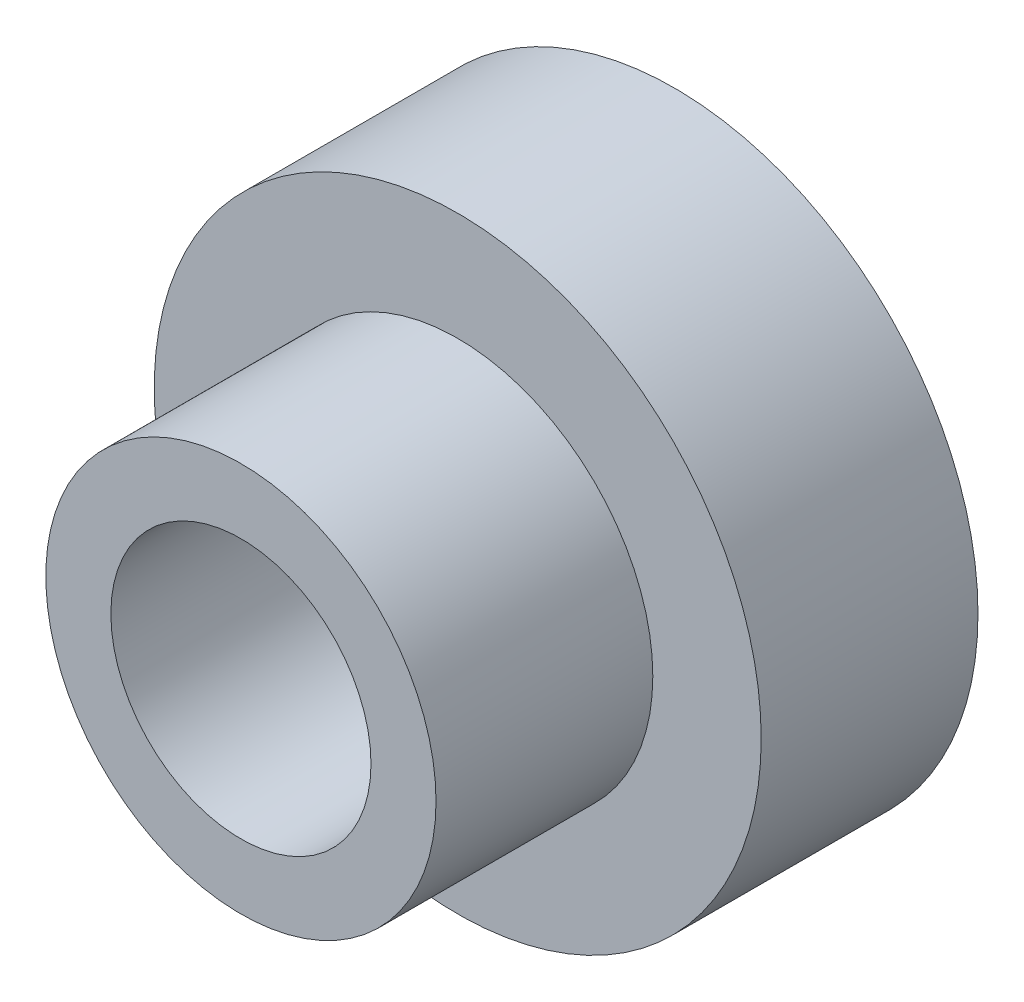
ISO-10303-21;
HEADER;
FILE_DESCRIPTION(('STEP AP214'),'2;1');
FILE_NAME('part.step','',(''),(''),'','','');
FILE_SCHEMA(('AUTOMOTIVE_DESIGN { 1 0 10303 214 1 1 1 1 }'));
ENDSEC;
DATA;
#1=APPLICATION_CONTEXT('core data for automotive mechanical design processes');
#2=APPLICATION_PROTOCOL_DEFINITION('international standard','automotive_design',2000,#1);
#3=PRODUCT_CONTEXT('',#1,'mechanical');
#4=PRODUCT('Part','Part','',(#3));
#5=PRODUCT_RELATED_PRODUCT_CATEGORY('part','',(#4));
#6=PRODUCT_DEFINITION_FORMATION('','',#4);
#7=PRODUCT_DEFINITION_CONTEXT('part definition',#1,'design');
#8=PRODUCT_DEFINITION('design','',#6,#7);
#9=PRODUCT_DEFINITION_SHAPE('','',#8);
#10=(LENGTH_UNIT() NAMED_UNIT(*) SI_UNIT(.MILLI.,.METRE.));
#11=(NAMED_UNIT(*) PLANE_ANGLE_UNIT() SI_UNIT($,.RADIAN.));
#12=(NAMED_UNIT(*) SI_UNIT($,.STERADIAN.) SOLID_ANGLE_UNIT());
#13=UNCERTAINTY_MEASURE_WITH_UNIT(LENGTH_MEASURE(1.E-05),#10,'distance_accuracy_value','');
#14=(GEOMETRIC_REPRESENTATION_CONTEXT(3) GLOBAL_UNCERTAINTY_ASSIGNED_CONTEXT((#13)) GLOBAL_UNIT_ASSIGNED_CONTEXT((#10,
#11,#12)) REPRESENTATION_CONTEXT('',''));
#15=CARTESIAN_POINT('',(0.,0.,0.));
#16=DIRECTION('',(0.,0.,1.));
#17=DIRECTION('',(1.,0.,0.));
#18=AXIS2_PLACEMENT_3D('',#15,#16,#17);
#19=CARTESIAN_POINT('',(0.,0.,10.));
#20=DIRECTION('',(0.,0.,-1.));
#21=DIRECTION('',(-1.,0.,0.));
#22=AXIS2_PLACEMENT_3D('',#19,#20,#21);
#23=CYLINDRICAL_SURFACE('',#22,14.);
#24=CARTESIAN_POINT('',(0.,0.,10.));
#25=DIRECTION('',(0.,0.,1.));
#26=DIRECTION('',(1.,0.,0.));
#27=AXIS2_PLACEMENT_3D('',#24,#25,#26);
#28=CIRCLE('',#27,14.);
#29=CARTESIAN_POINT('',(14.,0.,10.));
#30=VERTEX_POINT('',#29);
#31=EDGE_CURVE('E38',#30,#30,#28,.T.);
#32=ORIENTED_EDGE('',*,*,#31,.F.);
#33=EDGE_LOOP('',(#32));
#34=FACE_BOUND('',#33,.T.);
#35=CARTESIAN_POINT('',(0.,0.,0.));
#36=DIRECTION('',(0.,0.,1.));
#37=DIRECTION('',(1.,0.,0.));
#38=AXIS2_PLACEMENT_3D('',#35,#36,#37);
#39=CIRCLE('',#38,14.);
#40=CARTESIAN_POINT('',(14.,0.,0.));
#41=VERTEX_POINT('',#40);
#42=EDGE_CURVE('E34',#41,#41,#39,.T.);
#43=ORIENTED_EDGE('',*,*,#42,.T.);
#44=EDGE_LOOP('',(#43));
#45=FACE_BOUND('',#44,.T.);
#46=ADVANCED_FACE('F31',(#34,#45),#23,.T.);
#47=CARTESIAN_POINT('',(0.,0.,10.));
#48=DIRECTION('',(0.,0.,1.));
#49=DIRECTION('',(1.,0.,0.));
#50=AXIS2_PLACEMENT_3D('',#47,#48,#49);
#51=PLANE('',#50);
#52=CARTESIAN_POINT('',(0.,0.,10.));
#53=DIRECTION('',(0.,0.,1.));
#54=DIRECTION('',(1.,0.,0.));
#55=AXIS2_PLACEMENT_3D('',#52,#53,#54);
#56=CIRCLE('',#55,9.);
#57=CARTESIAN_POINT('',(9.,0.,10.));
#58=VERTEX_POINT('',#57);
#59=EDGE_CURVE('E10',#58,#58,#56,.T.);
#60=ORIENTED_EDGE('',*,*,#59,.F.);
#61=EDGE_LOOP('',(#60));
#62=FACE_BOUND('',#61,.T.);
#63=ORIENTED_EDGE('',*,*,#31,.T.);
#64=EDGE_LOOP('',(#63));
#65=FACE_BOUND('',#64,.T.);
#66=ADVANCED_FACE('F75',(#62,#65),#51,.T.);
#67=CARTESIAN_POINT('',(0.,0.,0.));
#68=DIRECTION('',(0.,0.,1.));
#69=DIRECTION('',(1.,0.,0.));
#70=AXIS2_PLACEMENT_3D('',#67,#68,#69);
#71=PLANE('',#70);
#72=CARTESIAN_POINT('',(0.,0.,0.));
#73=DIRECTION('',(0.,0.,1.));
#74=DIRECTION('',(1.,0.,0.));
#75=AXIS2_PLACEMENT_3D('',#72,#73,#74);
#76=CIRCLE('',#75,6.);
#77=CARTESIAN_POINT('',(6.,0.,0.));
#78=VERTEX_POINT('',#77);
#79=EDGE_CURVE('E47',#78,#78,#76,.T.);
#80=ORIENTED_EDGE('',*,*,#79,.T.);
#81=EDGE_LOOP('',(#80));
#82=FACE_BOUND('',#81,.T.);
#83=ORIENTED_EDGE('',*,*,#42,.F.);
#84=EDGE_LOOP('',(#83));
#85=FACE_BOUND('',#84,.T.);
#86=ADVANCED_FACE('F54',(#82,#85),#71,.F.);
#87=CARTESIAN_POINT('',(0.,0.,20.));
#88=DIRECTION('',(0.,0.,-1.));
#89=DIRECTION('',(-1.,0.,0.));
#90=AXIS2_PLACEMENT_3D('',#87,#88,#89);
#91=CYLINDRICAL_SURFACE('',#90,9.);
#92=CARTESIAN_POINT('',(0.,0.,20.));
#93=DIRECTION('',(0.,0.,1.));
#94=DIRECTION('',(1.,0.,0.));
#95=AXIS2_PLACEMENT_3D('',#92,#93,#94);
#96=CIRCLE('',#95,9.);
#97=CARTESIAN_POINT('',(9.,0.,20.));
#98=VERTEX_POINT('',#97);
#99=EDGE_CURVE('E44',#98,#98,#96,.T.);
#100=ORIENTED_EDGE('',*,*,#99,.F.);
#101=EDGE_LOOP('',(#100));
#102=FACE_BOUND('',#101,.T.);
#103=ORIENTED_EDGE('',*,*,#59,.T.);
#104=EDGE_LOOP('',(#103));
#105=FACE_BOUND('',#104,.T.);
#106=ADVANCED_FACE('F66',(#102,#105),#91,.T.);
#107=CARTESIAN_POINT('',(0.,0.,20.));
#108=DIRECTION('',(0.,0.,1.));
#109=DIRECTION('',(1.,0.,0.));
#110=AXIS2_PLACEMENT_3D('',#107,#108,#109);
#111=PLANE('',#110);
#112=CARTESIAN_POINT('',(0.,0.,20.));
#113=DIRECTION('',(0.,0.,1.));
#114=DIRECTION('',(1.,0.,0.));
#115=AXIS2_PLACEMENT_3D('',#112,#113,#114);
#116=CIRCLE('',#115,6.);
#117=CARTESIAN_POINT('',(6.,0.,20.));
#118=VERTEX_POINT('',#117);
#119=EDGE_CURVE('E48',#118,#118,#116,.T.);
#120=ORIENTED_EDGE('',*,*,#119,.F.);
#121=EDGE_LOOP('',(#120));
#122=FACE_BOUND('',#121,.T.);
#123=ORIENTED_EDGE('',*,*,#99,.T.);
#124=EDGE_LOOP('',(#123));
#125=FACE_BOUND('',#124,.T.);
#126=ADVANCED_FACE('F60',(#122,#125),#111,.T.);
#127=CARTESIAN_POINT('',(0.,0.,0.));
#128=DIRECTION('',(0.,0.,1.));
#129=DIRECTION('',(1.,0.,0.));
#130=AXIS2_PLACEMENT_3D('',#127,#128,#129);
#131=CYLINDRICAL_SURFACE('',#130,6.);
#132=ORIENTED_EDGE('',*,*,#79,.F.);
#133=EDGE_LOOP('',(#132));
#134=FACE_BOUND('',#133,.T.);
#135=ORIENTED_EDGE('',*,*,#119,.T.);
#136=EDGE_LOOP('',(#135));
#137=FACE_BOUND('',#136,.T.);
#138=ADVANCED_FACE('F57',(#134,#137),#131,.F.);
#139=CLOSED_SHELL('',(#46,#66,#86,#106,#126,#138));
#140=MANIFOLD_SOLID_BREP('B2',#139);
#141=ADVANCED_BREP_SHAPE_REPRESENTATION('',(#18,#140),#14);
#142=SHAPE_DEFINITION_REPRESENTATION(#9,#141);
ENDSEC;
END-ISO-10303-21;
